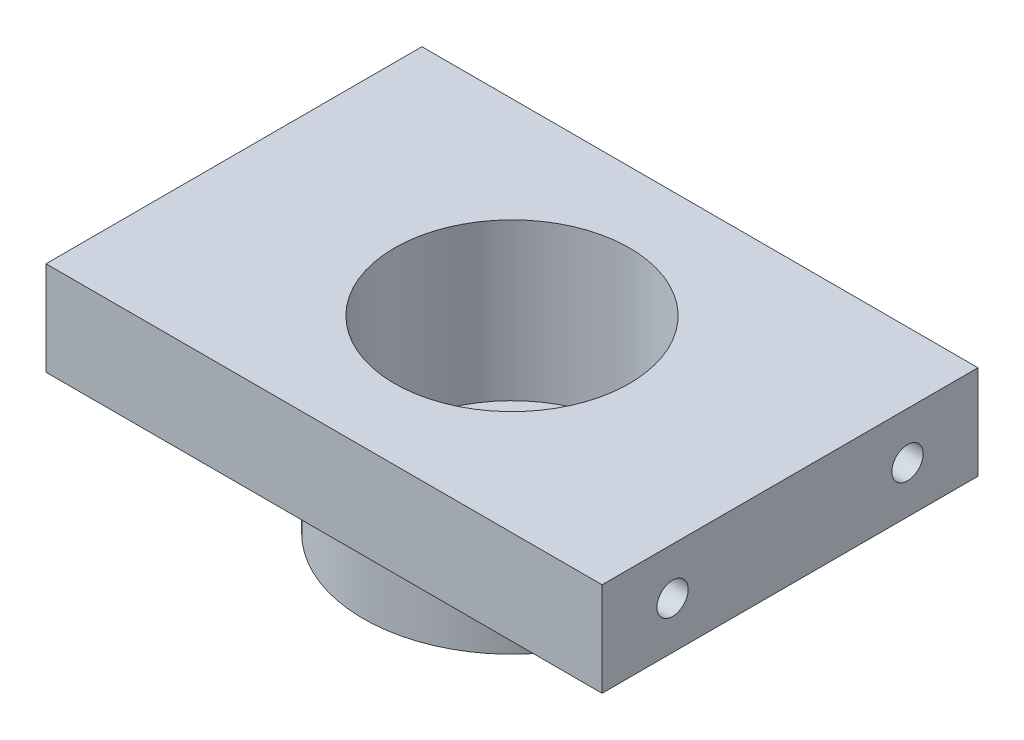
ISO-10303-21;
HEADER;
FILE_DESCRIPTION(('STEP AP214'),'2;1');
FILE_NAME('part.step','',(''),(''),'','','');
FILE_SCHEMA(('AUTOMOTIVE_DESIGN { 1 0 10303 214 1 1 1 1 }'));
ENDSEC;
DATA;
#1=APPLICATION_CONTEXT('core data for automotive mechanical design processes');
#2=APPLICATION_PROTOCOL_DEFINITION('international standard','automotive_design',2000,#1);
#3=PRODUCT_CONTEXT('',#1,'mechanical');
#4=PRODUCT('Part','Part','',(#3));
#5=PRODUCT_RELATED_PRODUCT_CATEGORY('part','',(#4));
#6=PRODUCT_DEFINITION_FORMATION('','',#4);
#7=PRODUCT_DEFINITION_CONTEXT('part definition',#1,'design');
#8=PRODUCT_DEFINITION('design','',#6,#7);
#9=PRODUCT_DEFINITION_SHAPE('','',#8);
#10=(LENGTH_UNIT() NAMED_UNIT(*) SI_UNIT(.MILLI.,.METRE.));
#11=(NAMED_UNIT(*) PLANE_ANGLE_UNIT() SI_UNIT($,.RADIAN.));
#12=(NAMED_UNIT(*) SI_UNIT($,.STERADIAN.) SOLID_ANGLE_UNIT());
#13=UNCERTAINTY_MEASURE_WITH_UNIT(LENGTH_MEASURE(1.E-05),#10,'distance_accuracy_value','');
#14=(GEOMETRIC_REPRESENTATION_CONTEXT(3) GLOBAL_UNCERTAINTY_ASSIGNED_CONTEXT((#13)) GLOBAL_UNIT_ASSIGNED_CONTEXT((#10,
#11,#12)) REPRESENTATION_CONTEXT('',''));
#15=CARTESIAN_POINT('',(0.,0.,0.));
#16=DIRECTION('',(0.,0.,1.));
#17=DIRECTION('',(1.,0.,0.));
#18=AXIS2_PLACEMENT_3D('',#15,#16,#17);
#19=CARTESIAN_POINT('',(59.,0.,0.));
#20=DIRECTION('',(0.,-1.,0.));
#21=DIRECTION('',(1.,0.,0.));
#22=AXIS2_PLACEMENT_3D('',#19,#20,#21);
#23=PLANE('',#22);
#24=CARTESIAN_POINT('',(0.,0.,0.));
#25=DIRECTION('',(0.,1.,0.));
#26=DIRECTION('',(-1.,0.,0.));
#27=AXIS2_PLACEMENT_3D('',#24,#25,#26);
#28=CIRCLE('',#27,15.);
#29=CARTESIAN_POINT('',(-15.,0.,0.));
#30=VERTEX_POINT('',#29);
#31=EDGE_CURVE('E122',#30,#30,#28,.T.);
#32=ORIENTED_EDGE('',*,*,#31,.F.);
#33=EDGE_LOOP('',(#32));
#34=FACE_BOUND('',#33,.T.);
#35=DIRECTION('',(1.,0.,0.));
#36=VECTOR('',#35,1.);
#37=CARTESIAN_POINT('',(35.5,0.,-24.));
#38=LINE('',#37,#36);
#39=CARTESIAN_POINT('',(-35.5000000000001,0.,-24.));
#40=VERTEX_POINT('',#39);
#41=CARTESIAN_POINT('',(35.5,0.,-24.));
#42=VERTEX_POINT('',#41);
#43=EDGE_CURVE('E47',#40,#42,#38,.T.);
#44=ORIENTED_EDGE('',*,*,#43,.F.);
#45=DIRECTION('',(0.,0.,-1.));
#46=VECTOR('',#45,1.);
#47=CARTESIAN_POINT('',(-35.5000000000001,0.,-24.));
#48=LINE('',#47,#46);
#49=CARTESIAN_POINT('',(-35.5000000000001,0.,24.));
#50=VERTEX_POINT('',#49);
#51=EDGE_CURVE('E77',#50,#40,#48,.T.);
#52=ORIENTED_EDGE('',*,*,#51,.F.);
#53=DIRECTION('',(-1.,0.,0.));
#54=VECTOR('',#53,1.);
#55=CARTESIAN_POINT('',(35.5,0.,24.));
#56=LINE('',#55,#54);
#57=CARTESIAN_POINT('',(35.5,0.,24.));
#58=VERTEX_POINT('',#57);
#59=EDGE_CURVE('E84',#58,#50,#56,.T.);
#60=ORIENTED_EDGE('',*,*,#59,.F.);
#61=DIRECTION('',(0.,0.,1.));
#62=VECTOR('',#61,1.);
#63=CARTESIAN_POINT('',(35.5,0.,-24.));
#64=LINE('',#63,#62);
#65=EDGE_CURVE('E89',#42,#58,#64,.T.);
#66=ORIENTED_EDGE('',*,*,#65,.F.);
#67=EDGE_LOOP('',(#44,#52,#60,#66));
#68=FACE_BOUND('',#67,.T.);
#69=ADVANCED_FACE('F31',(#34,#68),#23,.F.);
#70=CARTESIAN_POINT('',(19.,-12.,0.));
#71=DIRECTION('',(0.,1.,0.));
#72=DIRECTION('',(-1.,0.,0.));
#73=AXIS2_PLACEMENT_3D('',#70,#71,#72);
#74=PLANE('',#73);
#75=CARTESIAN_POINT('',(0.,-12.,0.));
#76=DIRECTION('',(0.,1.,0.));
#77=DIRECTION('',(-1.,0.,0.));
#78=AXIS2_PLACEMENT_3D('',#75,#76,#77);
#79=CIRCLE('',#78,19.);
#80=CARTESIAN_POINT('',(-19.,-12.,0.));
#81=VERTEX_POINT('',#80);
#82=EDGE_CURVE('E12',#81,#81,#79,.T.);
#83=ORIENTED_EDGE('',*,*,#82,.T.);
#84=EDGE_LOOP('',(#83));
#85=FACE_BOUND('',#84,.T.);
#86=DIRECTION('',(1.,0.,0.));
#87=VECTOR('',#86,1.);
#88=CARTESIAN_POINT('',(35.5,-12.,-24.));
#89=LINE('',#88,#87);
#90=CARTESIAN_POINT('',(-35.5000000000001,-12.,-24.));
#91=VERTEX_POINT('',#90);
#92=CARTESIAN_POINT('',(35.5,-12.,-24.));
#93=VERTEX_POINT('',#92);
#94=EDGE_CURVE('E96',#91,#93,#89,.T.);
#95=ORIENTED_EDGE('',*,*,#94,.T.);
#96=DIRECTION('',(0.,0.,1.));
#97=VECTOR('',#96,1.);
#98=CARTESIAN_POINT('',(35.5,-12.,-24.));
#99=LINE('',#98,#97);
#100=CARTESIAN_POINT('',(35.5,-12.,24.));
#101=VERTEX_POINT('',#100);
#102=EDGE_CURVE('E99',#93,#101,#99,.T.);
#103=ORIENTED_EDGE('',*,*,#102,.T.);
#104=DIRECTION('',(-1.,0.,0.));
#105=VECTOR('',#104,1.);
#106=CARTESIAN_POINT('',(35.5,-12.,24.));
#107=LINE('',#106,#105);
#108=CARTESIAN_POINT('',(-35.5000000000001,-12.,24.));
#109=VERTEX_POINT('',#108);
#110=EDGE_CURVE('E55',#101,#109,#107,.T.);
#111=ORIENTED_EDGE('',*,*,#110,.T.);
#112=DIRECTION('',(0.,0.,-1.));
#113=VECTOR('',#112,1.);
#114=CARTESIAN_POINT('',(-35.5000000000001,-12.,-24.));
#115=LINE('',#114,#113);
#116=EDGE_CURVE('E79',#109,#91,#115,.T.);
#117=ORIENTED_EDGE('',*,*,#116,.T.);
#118=EDGE_LOOP('',(#95,#103,#111,#117));
#119=FACE_BOUND('',#118,.T.);
#120=ADVANCED_FACE('F162',(#85,#119),#74,.F.);
#121=CARTESIAN_POINT('',(0.,0.,0.));
#122=DIRECTION('',(0.,1.,0.));
#123=DIRECTION('',(-1.,0.,0.));
#124=AXIS2_PLACEMENT_3D('',#121,#122,#123);
#125=CYLINDRICAL_SURFACE('',#124,19.);
#126=ORIENTED_EDGE('',*,*,#82,.F.);
#127=EDGE_LOOP('',(#126));
#128=FACE_BOUND('',#127,.T.);
#129=CARTESIAN_POINT('',(0.,-24.,0.));
#130=DIRECTION('',(0.,1.,0.));
#131=DIRECTION('',(-1.,0.,0.));
#132=AXIS2_PLACEMENT_3D('',#129,#130,#131);
#133=CIRCLE('',#132,19.);
#134=CARTESIAN_POINT('',(-19.,-24.,0.));
#135=VERTEX_POINT('',#134);
#136=EDGE_CURVE('E39',#135,#135,#133,.T.);
#137=ORIENTED_EDGE('',*,*,#136,.T.);
#138=EDGE_LOOP('',(#137));
#139=FACE_BOUND('',#138,.T.);
#140=ADVANCED_FACE('F167',(#128,#139),#125,.T.);
#141=CARTESIAN_POINT('',(9.,-24.,0.));
#142=DIRECTION('',(0.,1.,0.));
#143=DIRECTION('',(-1.,0.,0.));
#144=AXIS2_PLACEMENT_3D('',#141,#142,#143);
#145=PLANE('',#144);
#146=CARTESIAN_POINT('',(-12.9999999999998,-24.,-1.81557108488227E-13));
#147=DIRECTION('',(0.,-1.,0.));
#148=DIRECTION('',(1.,0.,0.));
#149=AXIS2_PLACEMENT_3D('',#146,#147,#148);
#150=CIRCLE('',#149,1.50000000000036);
#151=CARTESIAN_POINT('',(-11.4999999999995,-24.,-1.81557108488227E-13));
#152=VERTEX_POINT('',#151);
#153=EDGE_CURVE('E105',#152,#152,#150,.T.);
#154=ORIENTED_EDGE('',*,*,#153,.F.);
#155=EDGE_LOOP('',(#154));
#156=FACE_BOUND('',#155,.T.);
#157=CARTESIAN_POINT('',(2.7968506284591E-13,-24.,-12.9999999999999));
#158=DIRECTION('',(0.,-1.,0.));
#159=DIRECTION('',(1.,0.,0.));
#160=AXIS2_PLACEMENT_3D('',#157,#158,#159);
#161=CIRCLE('',#160,1.50000000000038);
#162=CARTESIAN_POINT('',(1.50000000000066,-24.,-12.9999999999999));
#163=VERTEX_POINT('',#162);
#164=EDGE_CURVE('E110',#163,#163,#161,.T.);
#165=ORIENTED_EDGE('',*,*,#164,.F.);
#166=EDGE_LOOP('',(#165));
#167=FACE_BOUND('',#166,.T.);
#168=CARTESIAN_POINT('',(13.,-24.,0.));
#169=DIRECTION('',(0.,-1.,0.));
#170=DIRECTION('',(1.,0.,0.));
#171=AXIS2_PLACEMENT_3D('',#168,#169,#170);
#172=CIRCLE('',#171,1.5);
#173=CARTESIAN_POINT('',(14.5,-24.,0.));
#174=VERTEX_POINT('',#173);
#175=EDGE_CURVE('E114',#174,#174,#172,.T.);
#176=ORIENTED_EDGE('',*,*,#175,.F.);
#177=EDGE_LOOP('',(#176));
#178=FACE_BOUND('',#177,.T.);
#179=CARTESIAN_POINT('',(0.,-24.,13.));
#180=DIRECTION('',(0.,-1.,0.));
#181=DIRECTION('',(1.,0.,0.));
#182=AXIS2_PLACEMENT_3D('',#179,#180,#181);
#183=CIRCLE('',#182,1.5);
#184=CARTESIAN_POINT('',(1.5,-24.,13.));
#185=VERTEX_POINT('',#184);
#186=EDGE_CURVE('E118',#185,#185,#183,.T.);
#187=ORIENTED_EDGE('',*,*,#186,.F.);
#188=EDGE_LOOP('',(#187));
#189=FACE_BOUND('',#188,.T.);
#190=ORIENTED_EDGE('',*,*,#136,.F.);
#191=EDGE_LOOP('',(#190));
#192=FACE_BOUND('',#191,.T.);
#193=CARTESIAN_POINT('',(0.,-24.,0.));
#194=DIRECTION('',(0.,1.,0.));
#195=DIRECTION('',(-1.,0.,0.));
#196=AXIS2_PLACEMENT_3D('',#193,#194,#195);
#197=CIRCLE('',#196,9.);
#198=CARTESIAN_POINT('',(-8.99999999999999,-24.,0.));
#199=VERTEX_POINT('',#198);
#200=EDGE_CURVE('E131',#199,#199,#197,.T.);
#201=ORIENTED_EDGE('',*,*,#200,.T.);
#202=EDGE_LOOP('',(#201));
#203=FACE_BOUND('',#202,.T.);
#204=ADVANCED_FACE('F188',(#156,#167,#178,#189,#192,#203),#145,.F.);
#205=CARTESIAN_POINT('',(0.,0.,0.));
#206=DIRECTION('',(0.,1.,0.));
#207=DIRECTION('',(-1.,0.,0.));
#208=AXIS2_PLACEMENT_3D('',#205,#206,#207);
#209=CYLINDRICAL_SURFACE('',#208,9.);
#210=ORIENTED_EDGE('',*,*,#200,.F.);
#211=EDGE_LOOP('',(#210));
#212=FACE_BOUND('',#211,.T.);
#213=CARTESIAN_POINT('',(0.,-20.,0.));
#214=DIRECTION('',(0.,1.,0.));
#215=DIRECTION('',(-1.,0.,0.));
#216=AXIS2_PLACEMENT_3D('',#213,#214,#215);
#217=CIRCLE('',#216,9.);
#218=CARTESIAN_POINT('',(-9.,-20.,0.));
#219=VERTEX_POINT('',#218);
#220=EDGE_CURVE('E128',#219,#219,#217,.T.);
#221=ORIENTED_EDGE('',*,*,#220,.T.);
#222=EDGE_LOOP('',(#221));
#223=FACE_BOUND('',#222,.T.);
#224=ADVANCED_FACE('F181',(#212,#223),#209,.F.);
#225=CARTESIAN_POINT('',(15.,-20.,0.));
#226=DIRECTION('',(0.,-1.,0.));
#227=DIRECTION('',(1.,0.,0.));
#228=AXIS2_PLACEMENT_3D('',#225,#226,#227);
#229=PLANE('',#228);
#230=CARTESIAN_POINT('',(-12.9999999999998,-20.,-1.81557108488227E-13));
#231=DIRECTION('',(0.,-1.,0.));
#232=DIRECTION('',(1.,0.,0.));
#233=AXIS2_PLACEMENT_3D('',#230,#231,#232);
#234=CIRCLE('',#233,1.50000000000036);
#235=CARTESIAN_POINT('',(-11.4999999999995,-20.,-1.81557108488227E-13));
#236=VERTEX_POINT('',#235);
#237=EDGE_CURVE('E34',#236,#236,#234,.T.);
#238=ORIENTED_EDGE('',*,*,#237,.T.);
#239=EDGE_LOOP('',(#238));
#240=FACE_BOUND('',#239,.T.);
#241=CARTESIAN_POINT('',(2.79195204126251E-13,-20.,-12.9999999999999));
#242=DIRECTION('',(0.,-1.,0.));
#243=DIRECTION('',(1.,0.,0.));
#244=AXIS2_PLACEMENT_3D('',#241,#242,#243);
#245=CIRCLE('',#244,1.50000000000038);
#246=CARTESIAN_POINT('',(1.50000000000066,-20.,-12.9999999999999));
#247=VERTEX_POINT('',#246);
#248=EDGE_CURVE('E113',#247,#247,#245,.T.);
#249=ORIENTED_EDGE('',*,*,#248,.T.);
#250=EDGE_LOOP('',(#249));
#251=FACE_BOUND('',#250,.T.);
#252=CARTESIAN_POINT('',(13.,-20.,0.));
#253=DIRECTION('',(0.,-1.,0.));
#254=DIRECTION('',(1.,0.,0.));
#255=AXIS2_PLACEMENT_3D('',#252,#253,#254);
#256=CIRCLE('',#255,1.5);
#257=CARTESIAN_POINT('',(14.5,-20.,0.));
#258=VERTEX_POINT('',#257);
#259=EDGE_CURVE('E117',#258,#258,#256,.T.);
#260=ORIENTED_EDGE('',*,*,#259,.T.);
#261=EDGE_LOOP('',(#260));
#262=FACE_BOUND('',#261,.T.);
#263=CARTESIAN_POINT('',(0.,-20.,13.));
#264=DIRECTION('',(0.,-1.,0.));
#265=DIRECTION('',(1.,0.,0.));
#266=AXIS2_PLACEMENT_3D('',#263,#264,#265);
#267=CIRCLE('',#266,1.5);
#268=CARTESIAN_POINT('',(1.5,-20.,13.));
#269=VERTEX_POINT('',#268);
#270=EDGE_CURVE('E121',#269,#269,#267,.T.);
#271=ORIENTED_EDGE('',*,*,#270,.T.);
#272=EDGE_LOOP('',(#271));
#273=FACE_BOUND('',#272,.T.);
#274=ORIENTED_EDGE('',*,*,#220,.F.);
#275=EDGE_LOOP('',(#274));
#276=FACE_BOUND('',#275,.T.);
#277=CARTESIAN_POINT('',(0.,-20.,0.));
#278=DIRECTION('',(0.,1.,0.));
#279=DIRECTION('',(-1.,0.,0.));
#280=AXIS2_PLACEMENT_3D('',#277,#278,#279);
#281=CIRCLE('',#280,15.);
#282=CARTESIAN_POINT('',(-15.,-20.,0.));
#283=VERTEX_POINT('',#282);
#284=EDGE_CURVE('E125',#283,#283,#281,.T.);
#285=ORIENTED_EDGE('',*,*,#284,.T.);
#286=EDGE_LOOP('',(#285));
#287=FACE_BOUND('',#286,.T.);
#288=ADVANCED_FACE('F142',(#240,#251,#262,#273,#276,#287),#229,.F.);
#289=CARTESIAN_POINT('',(0.,0.,0.));
#290=DIRECTION('',(0.,1.,0.));
#291=DIRECTION('',(-1.,0.,0.));
#292=AXIS2_PLACEMENT_3D('',#289,#290,#291);
#293=CYLINDRICAL_SURFACE('',#292,15.);
#294=ORIENTED_EDGE('',*,*,#284,.F.);
#295=EDGE_LOOP('',(#294));
#296=FACE_BOUND('',#295,.T.);
#297=ORIENTED_EDGE('',*,*,#31,.T.);
#298=EDGE_LOOP('',(#297));
#299=FACE_BOUND('',#298,.T.);
#300=ADVANCED_FACE('F171',(#296,#299),#293,.F.);
#301=CARTESIAN_POINT('',(0.,0.,13.));
#302=DIRECTION('',(0.,-1.,0.));
#303=DIRECTION('',(1.,0.,0.));
#304=AXIS2_PLACEMENT_3D('',#301,#302,#303);
#305=CYLINDRICAL_SURFACE('',#304,1.5);
#306=ORIENTED_EDGE('',*,*,#186,.T.);
#307=EDGE_LOOP('',(#306));
#308=FACE_BOUND('',#307,.T.);
#309=ORIENTED_EDGE('',*,*,#270,.F.);
#310=EDGE_LOOP('',(#309));
#311=FACE_BOUND('',#310,.T.);
#312=ADVANCED_FACE('F158',(#308,#311),#305,.F.);
#313=CARTESIAN_POINT('',(13.,0.,0.));
#314=DIRECTION('',(0.,-1.,0.));
#315=DIRECTION('',(1.,0.,0.));
#316=AXIS2_PLACEMENT_3D('',#313,#314,#315);
#317=CYLINDRICAL_SURFACE('',#316,1.5);
#318=ORIENTED_EDGE('',*,*,#175,.T.);
#319=EDGE_LOOP('',(#318));
#320=FACE_BOUND('',#319,.T.);
#321=ORIENTED_EDGE('',*,*,#259,.F.);
#322=EDGE_LOOP('',(#321));
#323=FACE_BOUND('',#322,.T.);
#324=ADVANCED_FACE('F148',(#320,#323),#317,.F.);
#325=CARTESIAN_POINT('',(2.76745910527956E-13,0.,-12.9999999999999));
#326=DIRECTION('',(0.,-1.,0.));
#327=DIRECTION('',(1.,0.,0.));
#328=AXIS2_PLACEMENT_3D('',#325,#326,#327);
#329=CYLINDRICAL_SURFACE('',#328,1.50000000000038);
#330=ORIENTED_EDGE('',*,*,#164,.T.);
#331=EDGE_LOOP('',(#330));
#332=FACE_BOUND('',#331,.T.);
#333=ORIENTED_EDGE('',*,*,#248,.F.);
#334=EDGE_LOOP('',(#333));
#335=FACE_BOUND('',#334,.T.);
#336=ADVANCED_FACE('F145',(#332,#335),#329,.F.);
#337=CARTESIAN_POINT('',(-12.9999999999998,0.,-1.81557108488227E-13));
#338=DIRECTION('',(0.,-1.,0.));
#339=DIRECTION('',(1.,0.,0.));
#340=AXIS2_PLACEMENT_3D('',#337,#338,#339);
#341=CYLINDRICAL_SURFACE('',#340,1.50000000000036);
#342=ORIENTED_EDGE('',*,*,#153,.T.);
#343=EDGE_LOOP('',(#342));
#344=FACE_BOUND('',#343,.T.);
#345=ORIENTED_EDGE('',*,*,#237,.F.);
#346=EDGE_LOOP('',(#345));
#347=FACE_BOUND('',#346,.T.);
#348=ADVANCED_FACE('F147',(#344,#347),#341,.F.);
#349=CARTESIAN_POINT('',(35.5,0.,-24.));
#350=DIRECTION('',(0.,0.,-1.));
#351=DIRECTION('',(-1.,0.,0.));
#352=AXIS2_PLACEMENT_3D('',#349,#350,#351);
#353=PLANE('',#352);
#354=ORIENTED_EDGE('',*,*,#94,.F.);
#355=DIRECTION('',(0.,-1.,0.));
#356=VECTOR('',#355,1.);
#357=CARTESIAN_POINT('',(-35.5000000000001,0.,-24.));
#358=LINE('',#357,#356);
#359=EDGE_CURVE('E80',#40,#91,#358,.T.);
#360=ORIENTED_EDGE('',*,*,#359,.F.);
#361=ORIENTED_EDGE('',*,*,#43,.T.);
#362=DIRECTION('',(0.,-1.,0.));
#363=VECTOR('',#362,1.);
#364=CARTESIAN_POINT('',(35.5,0.,-24.));
#365=LINE('',#364,#363);
#366=EDGE_CURVE('E91',#42,#93,#365,.T.);
#367=ORIENTED_EDGE('',*,*,#366,.T.);
#368=EDGE_LOOP('',(#354,#360,#361,#367));
#369=FACE_BOUND('',#368,.T.);
#370=ADVANCED_FACE('F155',(#369),#353,.T.);
#371=CARTESIAN_POINT('',(-35.5000000000001,0.,-24.));
#372=DIRECTION('',(-1.,0.,0.));
#373=DIRECTION('',(0.,0.,1.));
#374=AXIS2_PLACEMENT_3D('',#371,#372,#373);
#375=PLANE('',#374);
#376=CARTESIAN_POINT('',(-35.5000000000001,-6.00000000000001,-15.));
#377=DIRECTION('',(-1.,0.,0.));
#378=DIRECTION('',(0.,0.,-1.));
#379=AXIS2_PLACEMENT_3D('',#376,#377,#378);
#380=CIRCLE('',#379,2.);
#381=CARTESIAN_POINT('',(-35.5000000000001,-6.00000000000001,-17.));
#382=VERTEX_POINT('',#381);
#383=EDGE_CURVE('E232',#382,#382,#380,.T.);
#384=ORIENTED_EDGE('',*,*,#383,.F.);
#385=EDGE_LOOP('',(#384));
#386=FACE_BOUND('',#385,.T.);
#387=CARTESIAN_POINT('',(-35.5000000000001,-6.00000000000001,15.));
#388=DIRECTION('',(-1.,0.,0.));
#389=DIRECTION('',(0.,0.,1.));
#390=AXIS2_PLACEMENT_3D('',#387,#388,#389);
#391=CIRCLE('',#390,2.);
#392=CARTESIAN_POINT('',(-35.5000000000001,-6.00000000000001,17.));
#393=VERTEX_POINT('',#392);
#394=EDGE_CURVE('E226',#393,#393,#391,.T.);
#395=ORIENTED_EDGE('',*,*,#394,.F.);
#396=EDGE_LOOP('',(#395));
#397=FACE_BOUND('',#396,.T.);
#398=ORIENTED_EDGE('',*,*,#116,.F.);
#399=DIRECTION('',(0.,-1.,0.));
#400=VECTOR('',#399,1.);
#401=CARTESIAN_POINT('',(-35.5000000000001,0.,24.));
#402=LINE('',#401,#400);
#403=EDGE_CURVE('E73',#50,#109,#402,.T.);
#404=ORIENTED_EDGE('',*,*,#403,.F.);
#405=ORIENTED_EDGE('',*,*,#51,.T.);
#406=ORIENTED_EDGE('',*,*,#359,.T.);
#407=EDGE_LOOP('',(#398,#404,#405,#406));
#408=FACE_BOUND('',#407,.T.);
#409=ADVANCED_FACE('F75',(#386,#397,#408),#375,.T.);
#410=CARTESIAN_POINT('',(35.5,0.,24.));
#411=DIRECTION('',(0.,0.,1.));
#412=DIRECTION('',(1.,0.,0.));
#413=AXIS2_PLACEMENT_3D('',#410,#411,#412);
#414=PLANE('',#413);
#415=ORIENTED_EDGE('',*,*,#110,.F.);
#416=DIRECTION('',(0.,-1.,0.));
#417=VECTOR('',#416,1.);
#418=CARTESIAN_POINT('',(35.5,0.,24.));
#419=LINE('',#418,#417);
#420=EDGE_CURVE('E81',#58,#101,#419,.T.);
#421=ORIENTED_EDGE('',*,*,#420,.F.);
#422=ORIENTED_EDGE('',*,*,#59,.T.);
#423=ORIENTED_EDGE('',*,*,#403,.T.);
#424=EDGE_LOOP('',(#415,#421,#422,#423));
#425=FACE_BOUND('',#424,.T.);
#426=ADVANCED_FACE('F85',(#425),#414,.T.);
#427=CARTESIAN_POINT('',(35.5,0.,-24.));
#428=DIRECTION('',(1.,0.,0.));
#429=DIRECTION('',(0.,0.,-1.));
#430=AXIS2_PLACEMENT_3D('',#427,#428,#429);
#431=PLANE('',#430);
#432=CARTESIAN_POINT('',(35.5,-6.,-15.));
#433=DIRECTION('',(1.,0.,0.));
#434=DIRECTION('',(0.,0.,1.));
#435=AXIS2_PLACEMENT_3D('',#432,#433,#434);
#436=CIRCLE('',#435,2.);
#437=CARTESIAN_POINT('',(35.5,-6.,-13.));
#438=VERTEX_POINT('',#437);
#439=EDGE_CURVE('E220',#438,#438,#436,.T.);
#440=ORIENTED_EDGE('',*,*,#439,.F.);
#441=EDGE_LOOP('',(#440));
#442=FACE_BOUND('',#441,.T.);
#443=CARTESIAN_POINT('',(35.5,-6.,15.));
#444=DIRECTION('',(1.,0.,0.));
#445=DIRECTION('',(0.,0.,-1.));
#446=AXIS2_PLACEMENT_3D('',#443,#444,#445);
#447=CIRCLE('',#446,2.);
#448=CARTESIAN_POINT('',(35.5,-6.,13.));
#449=VERTEX_POINT('',#448);
#450=EDGE_CURVE('E214',#449,#449,#447,.T.);
#451=ORIENTED_EDGE('',*,*,#450,.F.);
#452=EDGE_LOOP('',(#451));
#453=FACE_BOUND('',#452,.T.);
#454=ORIENTED_EDGE('',*,*,#102,.F.);
#455=ORIENTED_EDGE('',*,*,#366,.F.);
#456=ORIENTED_EDGE('',*,*,#65,.T.);
#457=ORIENTED_EDGE('',*,*,#420,.T.);
#458=EDGE_LOOP('',(#454,#455,#456,#457));
#459=FACE_BOUND('',#458,.T.);
#460=ADVANCED_FACE('F211',(#442,#453,#459),#431,.T.);
#461=CARTESIAN_POINT('',(25.5,-6.,15.));
#462=DIRECTION('',(1.,0.,0.));
#463=DIRECTION('',(0.,0.,-1.));
#464=AXIS2_PLACEMENT_3D('',#461,#462,#463);
#465=CYLINDRICAL_SURFACE('',#464,2.);
#466=CARTESIAN_POINT('',(25.5,-6.,15.));
#467=DIRECTION('',(1.,0.,0.));
#468=DIRECTION('',(0.,0.,-1.));
#469=AXIS2_PLACEMENT_3D('',#466,#467,#468);
#470=CIRCLE('',#469,2.);
#471=CARTESIAN_POINT('',(25.5,-6.,13.));
#472=VERTEX_POINT('',#471);
#473=EDGE_CURVE('E100',#472,#472,#470,.T.);
#474=ORIENTED_EDGE('',*,*,#473,.F.);
#475=EDGE_LOOP('',(#474));
#476=FACE_BOUND('',#475,.T.);
#477=ORIENTED_EDGE('',*,*,#450,.T.);
#478=EDGE_LOOP('',(#477));
#479=FACE_BOUND('',#478,.T.);
#480=ADVANCED_FACE('F274',(#476,#479),#465,.F.);
#481=CARTESIAN_POINT('',(25.5,-6.,15.));
#482=DIRECTION('',(1.,0.,0.));
#483=DIRECTION('',(0.,0.,-1.));
#484=AXIS2_PLACEMENT_3D('',#481,#482,#483);
#485=PLANE('',#484);
#486=ORIENTED_EDGE('',*,*,#473,.T.);
#487=EDGE_LOOP('',(#486));
#488=FACE_BOUND('',#487,.T.);
#489=ADVANCED_FACE('F270',(#488),#485,.T.);
#490=CARTESIAN_POINT('',(25.5,-6.,-15.));
#491=DIRECTION('',(1.,0.,0.));
#492=DIRECTION('',(0.,0.,-1.));
#493=AXIS2_PLACEMENT_3D('',#490,#491,#492);
#494=CYLINDRICAL_SURFACE('',#493,2.);
#495=CARTESIAN_POINT('',(25.5,-6.,-15.));
#496=DIRECTION('',(1.,0.,0.));
#497=DIRECTION('',(0.,0.,1.));
#498=AXIS2_PLACEMENT_3D('',#495,#496,#497);
#499=CIRCLE('',#498,2.);
#500=CARTESIAN_POINT('',(25.5,-6.,-13.));
#501=VERTEX_POINT('',#500);
#502=EDGE_CURVE('E217',#501,#501,#499,.T.);
#503=ORIENTED_EDGE('',*,*,#502,.F.);
#504=EDGE_LOOP('',(#503));
#505=FACE_BOUND('',#504,.T.);
#506=ORIENTED_EDGE('',*,*,#439,.T.);
#507=EDGE_LOOP('',(#506));
#508=FACE_BOUND('',#507,.T.);
#509=ADVANCED_FACE('F263',(#505,#508),#494,.F.);
#510=CARTESIAN_POINT('',(25.5,-6.,-15.));
#511=DIRECTION('',(-1.,0.,0.));
#512=DIRECTION('',(0.,0.,1.));
#513=AXIS2_PLACEMENT_3D('',#510,#511,#512);
#514=PLANE('',#513);
#515=ORIENTED_EDGE('',*,*,#502,.T.);
#516=EDGE_LOOP('',(#515));
#517=FACE_BOUND('',#516,.T.);
#518=ADVANCED_FACE('F254',(#517),#514,.F.);
#519=CARTESIAN_POINT('',(-25.5000000000001,-6.00000000000001,15.));
#520=DIRECTION('',(-1.,0.,0.));
#521=DIRECTION('',(0.,0.,1.));
#522=AXIS2_PLACEMENT_3D('',#519,#520,#521);
#523=CYLINDRICAL_SURFACE('',#522,2.);
#524=CARTESIAN_POINT('',(-25.5000000000001,-6.00000000000001,15.));
#525=DIRECTION('',(-1.,0.,0.));
#526=DIRECTION('',(0.,0.,1.));
#527=AXIS2_PLACEMENT_3D('',#524,#525,#526);
#528=CIRCLE('',#527,2.);
#529=CARTESIAN_POINT('',(-25.5000000000001,-6.00000000000001,17.));
#530=VERTEX_POINT('',#529);
#531=EDGE_CURVE('E223',#530,#530,#528,.T.);
#532=ORIENTED_EDGE('',*,*,#531,.F.);
#533=EDGE_LOOP('',(#532));
#534=FACE_BOUND('',#533,.T.);
#535=ORIENTED_EDGE('',*,*,#394,.T.);
#536=EDGE_LOOP('',(#535));
#537=FACE_BOUND('',#536,.T.);
#538=ADVANCED_FACE('F252',(#534,#537),#523,.F.);
#539=CARTESIAN_POINT('',(-25.5000000000001,-6.00000000000001,15.));
#540=DIRECTION('',(-1.,0.,0.));
#541=DIRECTION('',(0.,0.,1.));
#542=AXIS2_PLACEMENT_3D('',#539,#540,#541);
#543=PLANE('',#542);
#544=ORIENTED_EDGE('',*,*,#531,.T.);
#545=EDGE_LOOP('',(#544));
#546=FACE_BOUND('',#545,.T.);
#547=ADVANCED_FACE('F243',(#546),#543,.T.);
#548=CARTESIAN_POINT('',(-25.5000000000001,-6.00000000000001,-15.));
#549=DIRECTION('',(-1.,0.,0.));
#550=DIRECTION('',(0.,0.,1.));
#551=AXIS2_PLACEMENT_3D('',#548,#549,#550);
#552=CYLINDRICAL_SURFACE('',#551,2.);
#553=CARTESIAN_POINT('',(-25.5000000000001,-6.00000000000001,-15.));
#554=DIRECTION('',(-1.,0.,0.));
#555=DIRECTION('',(0.,0.,-1.));
#556=AXIS2_PLACEMENT_3D('',#553,#554,#555);
#557=CIRCLE('',#556,2.);
#558=CARTESIAN_POINT('',(-25.5000000000001,-6.00000000000001,-17.));
#559=VERTEX_POINT('',#558);
#560=EDGE_CURVE('E229',#559,#559,#557,.T.);
#561=ORIENTED_EDGE('',*,*,#560,.F.);
#562=EDGE_LOOP('',(#561));
#563=FACE_BOUND('',#562,.T.);
#564=ORIENTED_EDGE('',*,*,#383,.T.);
#565=EDGE_LOOP('',(#564));
#566=FACE_BOUND('',#565,.T.);
#567=ADVANCED_FACE('F240',(#563,#566),#552,.F.);
#568=CARTESIAN_POINT('',(-25.5000000000001,-6.00000000000001,-15.));
#569=DIRECTION('',(1.,0.,0.));
#570=DIRECTION('',(0.,0.,-1.));
#571=AXIS2_PLACEMENT_3D('',#568,#569,#570);
#572=PLANE('',#571);
#573=ORIENTED_EDGE('',*,*,#560,.T.);
#574=EDGE_LOOP('',(#573));
#575=FACE_BOUND('',#574,.T.);
#576=ADVANCED_FACE('F238',(#575),#572,.F.);
#577=CLOSED_SHELL('',(#69,#120,#140,#204,#224,#288,#300,#312,#324,#336,#348,#370,#409,#426,#460,
#480,#489,#509,#518,#538,#547,#567,#576));
#578=MANIFOLD_SOLID_BREP('B2',#577);
#579=ADVANCED_BREP_SHAPE_REPRESENTATION('',(#18,#578),#14);
#580=SHAPE_DEFINITION_REPRESENTATION(#9,#579);
ENDSEC;
END-ISO-10303-21;
